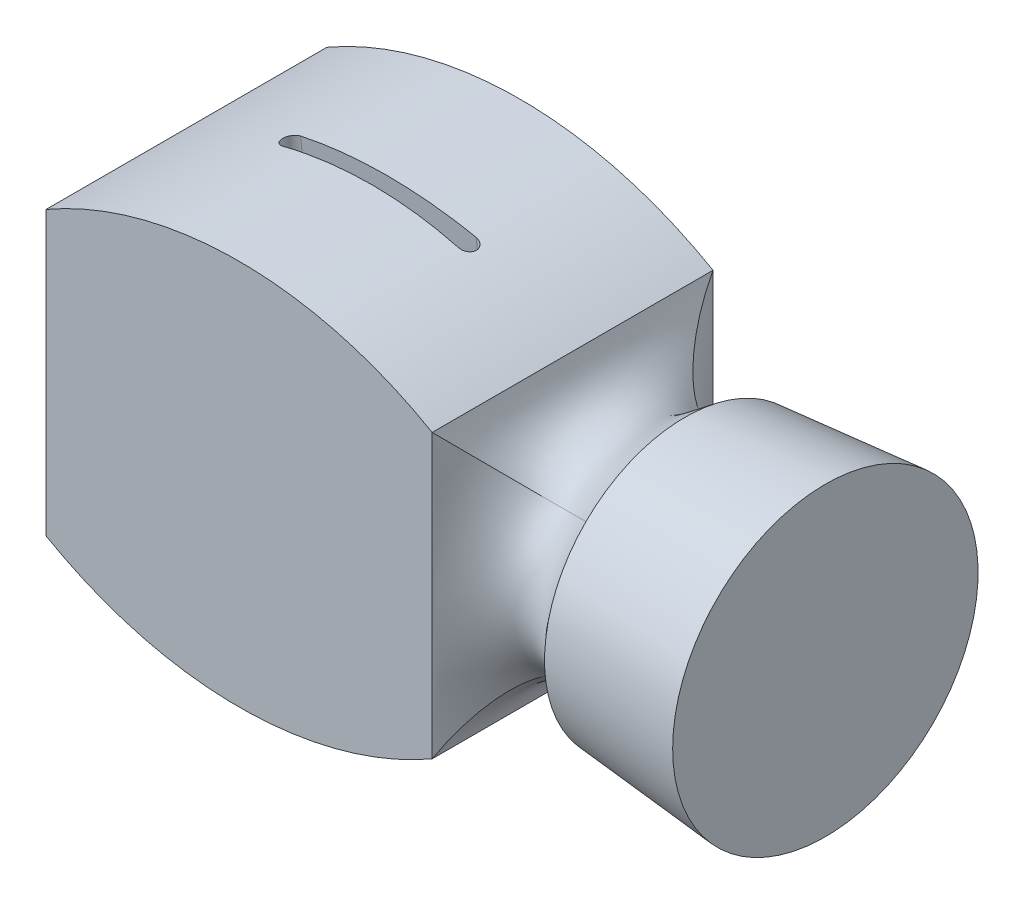
ISO-10303-21;
HEADER;
FILE_DESCRIPTION(('STEP AP214'),'2;1');
FILE_NAME('part.step','',(''),(''),'','','');
FILE_SCHEMA(('AUTOMOTIVE_DESIGN { 1 0 10303 214 1 1 1 1 }'));
ENDSEC;
DATA;
#1=APPLICATION_CONTEXT('core data for automotive mechanical design processes');
#2=APPLICATION_PROTOCOL_DEFINITION('international standard','automotive_design',2000,#1);
#3=PRODUCT_CONTEXT('',#1,'mechanical');
#4=PRODUCT('Part','Part','',(#3));
#5=PRODUCT_RELATED_PRODUCT_CATEGORY('part','',(#4));
#6=PRODUCT_DEFINITION_FORMATION('','',#4);
#7=PRODUCT_DEFINITION_CONTEXT('part definition',#1,'design');
#8=PRODUCT_DEFINITION('design','',#6,#7);
#9=PRODUCT_DEFINITION_SHAPE('','',#8);
#10=(LENGTH_UNIT() NAMED_UNIT(*) SI_UNIT(.MILLI.,.METRE.));
#11=(NAMED_UNIT(*) PLANE_ANGLE_UNIT() SI_UNIT($,.RADIAN.));
#12=(NAMED_UNIT(*) SI_UNIT($,.STERADIAN.) SOLID_ANGLE_UNIT());
#13=UNCERTAINTY_MEASURE_WITH_UNIT(LENGTH_MEASURE(1.E-05),#10,'distance_accuracy_value','');
#14=(GEOMETRIC_REPRESENTATION_CONTEXT(3) GLOBAL_UNCERTAINTY_ASSIGNED_CONTEXT((#13)) GLOBAL_UNIT_ASSIGNED_CONTEXT((#10,
#11,#12)) REPRESENTATION_CONTEXT('',''));
#15=CARTESIAN_POINT('',(0.,0.,0.));
#16=DIRECTION('',(0.,0.,1.));
#17=DIRECTION('',(1.,0.,0.));
#18=AXIS2_PLACEMENT_3D('',#15,#16,#17);
#19=CARTESIAN_POINT('',(0.,27.5,20.));
#20=DIRECTION('',(0.,0.,-1.));
#21=DIRECTION('',(-1.,0.,0.));
#22=AXIS2_PLACEMENT_3D('',#19,#20,#21);
#23=CYLINDRICAL_SURFACE('',#22,55.);
#24=CARTESIAN_POINT('',(0.,27.5,-20.));
#25=DIRECTION('',(0.,0.,1.));
#26=DIRECTION('',(1.,0.,0.));
#27=AXIS2_PLACEMENT_3D('',#24,#25,#26);
#28=CIRCLE('',#27,55.);
#29=CARTESIAN_POINT('',(-27.5,-20.1313972081441,-20.));
#30=VERTEX_POINT('',#29);
#31=CARTESIAN_POINT('',(27.5,-20.1313972081442,-20.));
#32=VERTEX_POINT('',#31);
#33=EDGE_CURVE('E342',#30,#32,#28,.T.);
#34=ORIENTED_EDGE('',*,*,#33,.T.);
#35=DIRECTION('',(0.,0.,-1.));
#36=VECTOR('',#35,1.);
#37=CARTESIAN_POINT('',(27.5,-20.1313972081441,20.));
#38=LINE('',#37,#36);
#39=CARTESIAN_POINT('',(27.5,-20.1313972081442,20.));
#40=VERTEX_POINT('',#39);
#41=EDGE_CURVE('E418',#40,#32,#38,.T.);
#42=ORIENTED_EDGE('',*,*,#41,.F.);
#43=CARTESIAN_POINT('',(0.,27.5,20.));
#44=DIRECTION('',(0.,0.,1.));
#45=DIRECTION('',(1.,0.,0.));
#46=AXIS2_PLACEMENT_3D('',#43,#44,#45);
#47=CIRCLE('',#46,55.);
#48=CARTESIAN_POINT('',(-27.5,-20.1313972081441,20.));
#49=VERTEX_POINT('',#48);
#50=EDGE_CURVE('E432',#49,#40,#47,.T.);
#51=ORIENTED_EDGE('',*,*,#50,.F.);
#52=DIRECTION('',(0.,0.,-1.));
#53=VECTOR('',#52,1.);
#54=CARTESIAN_POINT('',(-27.5,-20.1313972081441,20.));
#55=LINE('',#54,#53);
#56=EDGE_CURVE('E420',#49,#30,#55,.T.);
#57=ORIENTED_EDGE('',*,*,#56,.T.);
#58=EDGE_LOOP('',(#34,#42,#51,#57));
#59=FACE_BOUND('',#58,.T.);
#60=CARTESIAN_POINT('',(-12.4998,-26.0607598896804,6.73909623567953));
#61=CARTESIAN_POINT('',(-12.6933986230128,-26.0155895786751,6.73437127099308));
#62=CARTESIAN_POINT('',(-12.8865370150502,-25.9693982936842,6.72116380482105));
#63=CARTESIAN_POINT('',(-13.2705157264432,-25.8753890942664,6.67807874221884));
#64=CARTESIAN_POINT('',(-13.4613563922318,-25.8275714293182,6.6482036917799));
#65=CARTESIAN_POINT('',(-13.8392681013505,-25.7307501703658,6.57210769917102));
#66=CARTESIAN_POINT('',(-14.0263420870396,-25.6817475735146,6.52590008394693));
#67=CARTESIAN_POINT('',(-14.3956091503976,-25.5829817013322,6.41753635493682));
#68=CARTESIAN_POINT('',(-14.5778021209837,-25.53321840935,6.3553798915703));
#69=CARTESIAN_POINT('',(-14.9360328060622,-25.433444026986,6.21560746732323));
#70=CARTESIAN_POINT('',(-15.1120719910414,-25.3834329991087,6.13799522979766));
#71=CARTESIAN_POINT('',(-15.4569272657897,-25.2836682407866,5.96781267573446));
#72=CARTESIAN_POINT('',(-15.6257406785262,-25.2339146116036,5.87523687507781));
#73=CARTESIAN_POINT('',(-15.9548872673095,-25.1352646526776,5.67578671142501));
#74=CARTESIAN_POINT('',(-16.1152230527839,-25.0863680622711,5.56891678435569));
#75=CARTESIAN_POINT('',(-16.4264231970712,-24.9899911216893,5.34149288505637));
#76=CARTESIAN_POINT('',(-16.5772842743247,-24.9425112651549,5.22093421188979));
#77=CARTESIAN_POINT('',(-16.8693353984987,-24.8492996432912,4.96609901707708));
#78=CARTESIAN_POINT('',(-17.010457453876,-24.8035809938057,4.83173972568182));
#79=CARTESIAN_POINT('',(-17.2808969561019,-24.7148528479504,4.55080355121186));
#80=CARTESIAN_POINT('',(-17.4102147624871,-24.6718432690793,4.4042270405125));
#81=CARTESIAN_POINT('',(-17.6560466401239,-24.5891624389823,4.09976911503502));
#82=CARTESIAN_POINT('',(-17.772558164603,-24.5494918521446,3.94188546189015));
#83=CARTESIAN_POINT('',(-17.9917150660635,-24.4741437326796,3.61596416553342));
#84=CARTESIAN_POINT('',(-18.0943662969913,-24.4384645153814,3.44793085274331));
#85=CARTESIAN_POINT('',(-18.2821852842605,-24.3726452137291,3.10780601269508));
#86=CARTESIAN_POINT('',(-18.3677713386114,-24.3423752211145,2.93597063701547));
#87=CARTESIAN_POINT('',(-18.5242318456487,-24.2866752476319,2.58505335625933));
#88=CARTESIAN_POINT('',(-18.5951124771637,-24.2612432343479,2.40597453263682));
#89=CARTESIAN_POINT('',(-18.7215126445354,-24.215659935032,2.04184725389896));
#90=CARTESIAN_POINT('',(-18.7770343368178,-24.1955079077004,1.8567996408914));
#91=CARTESIAN_POINT('',(-18.8721632651499,-24.1608558050906,1.4821408777441));
#92=CARTESIAN_POINT('',(-18.9117711951019,-24.1463554833767,1.29252992696596));
#93=CARTESIAN_POINT('',(-18.9730585596742,-24.123870998546,0.91997613413624));
#94=CARTESIAN_POINT('',(-18.9955461848687,-24.1155933664036,0.737183540902859));
#95=CARTESIAN_POINT('',(-19.0255878113364,-24.104527587101,0.370211933173798));
#96=CARTESIAN_POINT('',(-19.0331423024459,-24.1017392598808,0.186032964352901));
#97=CARTESIAN_POINT('',(-19.0332430066832,-24.1017021047224,-0.182301940156798));
#98=CARTESIAN_POINT('',(-19.0257913864261,-24.1044524770947,-0.366457875332053));
#99=CARTESIAN_POINT('',(-18.9959583613963,-24.1154416621487,-0.733390169724651));
#100=CARTESIAN_POINT('',(-18.9735770666335,-24.1236804343889,-0.916166539097337));
#101=CARTESIAN_POINT('',(-18.914897551442,-24.1452088406323,-1.27415205667121));
#102=CARTESIAN_POINT('',(-18.8789854734279,-24.1583582501097,-1.44943315112719));
#103=CARTESIAN_POINT('',(-18.7935364114477,-24.1895062408266,-1.79626252287539));
#104=CARTESIAN_POINT('',(-18.7439948815252,-24.2075064399535,-1.96780953406702));
#105=CARTESIAN_POINT('',(-18.6317415182922,-24.2480604898581,-2.30592351966664));
#106=CARTESIAN_POINT('',(-18.5690335982871,-24.270612987528,-2.47249195703617));
#107=CARTESIAN_POINT('',(-18.4309355903424,-24.3199381261802,-2.79970821544439));
#108=CARTESIAN_POINT('',(-18.3555407299215,-24.3467123550233,-2.96035378063281));
#109=CARTESIAN_POINT('',(-18.1909173022932,-24.4047040624393,-3.27809005920096));
#110=CARTESIAN_POINT('',(-18.1014247944717,-24.4360051193682,-3.43502873040355));
#111=CARTESIAN_POINT('',(-17.9105041218743,-24.5021542626677,-3.74075331742193));
#112=CARTESIAN_POINT('',(-17.8090718397584,-24.5370035720634,-3.88953639476775));
#113=CARTESIAN_POINT('',(-17.5950467888048,-24.60976010422,-4.17802674737951));
#114=CARTESIAN_POINT('',(-17.4824549698597,-24.6476670666643,-4.31773479343341));
#115=CARTESIAN_POINT('',(-17.2468766088228,-24.7260534193872,-4.58732219686196));
#116=CARTESIAN_POINT('',(-17.123889598005,-24.7665329256429,-4.71720111053362));
#117=CARTESIAN_POINT('',(-16.8620524023629,-24.8516098086571,-4.97254509389729));
#118=CARTESIAN_POINT('',(-16.7227200258822,-24.8963117771305,-5.09748119879994));
#119=CARTESIAN_POINT('',(-16.4344969250793,-24.9874284501875,-5.33499973797696));
#120=CARTESIAN_POINT('',(-16.2856089381639,-25.0338426626567,-5.44758568539799));
#121=CARTESIAN_POINT('',(-15.9790631101051,-25.1278943791535,-5.65989491074874));
#122=CARTESIAN_POINT('',(-15.8213967782027,-25.1755330426781,-5.7596054144891));
#123=CARTESIAN_POINT('',(-15.4984942160129,-25.2714414426776,-5.94540439208028));
#124=CARTESIAN_POINT('',(-15.3332605660804,-25.3197109600862,-6.0314974653489));
#125=CARTESIAN_POINT('',(-14.9899286385814,-25.4181925493264,-6.19251258698327));
#126=CARTESIAN_POINT('',(-14.8115804242605,-25.4684100001874,-6.26689901101253));
#127=CARTESIAN_POINT('',(-14.4490717910435,-25.5684431780532,-6.39992386049626));
#128=CARTESIAN_POINT('',(-14.2649134977362,-25.6182590437905,-6.45856797222168));
#129=CARTESIAN_POINT('',(-13.8922860767618,-25.7169285109068,-6.5596013948447));
#130=CARTESIAN_POINT('',(-13.7038243930244,-25.765783536674,-6.60201680954808));
#131=CARTESIAN_POINT('',(-13.3236794505999,-25.8621398044004,-6.67032735956453));
#132=CARTESIAN_POINT('',(-13.1319982414434,-25.9096418593275,-6.69623262441011));
#133=CARTESIAN_POINT('',(-12.8663173362054,-25.9739520676846,-6.72039644340137));
#134=CARTESIAN_POINT('',(-12.7930998940024,-25.991515949582,-6.72583563688397));
#135=CARTESIAN_POINT('',(-12.6465455331854,-26.0263537757854,-6.73428466654579));
#136=CARTESIAN_POINT('',(-12.5732088492033,-26.0436280306414,-6.73729729268165));
#137=CARTESIAN_POINT('',(-12.4998,-26.0607598896804,-6.73909623567953));
#138=B_SPLINE_CURVE_WITH_KNOTS('',3,(#60,#61,#62,#63,#64,#65,#66,#67,#68,#69,#70,#71,#72,#73,
#74,#75,#76,#77,#78,#79,#80,#81,#82,#83,#84,#85,#86,#87,#88,#89,#90,#91,#92,#93,#94,#95,#96,#97,
#98,#99,#100,#101,#102,#103,#104,#105,#106,#107,#108,#109,#110,#111,#112,#113,#114,#115,#116,
#117,#118,#119,#120,#121,#122,#123,#124,#125,#126,#127,#128,#129,#130,#131,#132,#133,#134,#135,
#136,#137),.UNSPECIFIED.,.F.,.F.,(4,2,2,2,2,2,2,2,2,2,2,2,2,2,2,2,2,2,2,2,2,2,2,2,2,2,2,2,2,2,2,
2,2,2,2,2,2,2,4),(0.,0.59636044557011,1.19262982137834,1.78841377590823,2.38421079045609,
2.97986444848205,3.57573690957211,4.1714248794858,4.76731804055025,5.36702068937904,
5.96670506622062,6.56650848674251,7.16605778031484,7.74834435579328,8.33038577217038,
8.91234542724771,9.49427970385089,10.0466669181627,10.5990360127869,11.1513253608783,
11.7036106394509,12.2412008860415,12.7789706578923,13.3165808198701,13.8543936701002,
14.4038389820191,14.9534743241039,15.5030629216938,16.0526763138252,16.6292479140974,
17.2056550741787,17.7826297850139,18.3594091990297,18.9576750939366,19.5557245979138,
20.1528080561528,20.7495248300466,20.9759665058355,21.2021474561636),.UNSPECIFIED.);
#139=CARTESIAN_POINT('',(-12.5,-26.0607132140714,6.73909133284309));
#140=VERTEX_POINT('',#139);
#141=CARTESIAN_POINT('',(-12.5,-26.0607132140714,-6.73909133284309));
#142=VERTEX_POINT('',#141);
#143=EDGE_CURVE('E195',#140,#142,#138,.T.);
#144=ORIENTED_EDGE('',*,*,#143,.F.);
#145=CARTESIAN_POINT('',(0.,27.5,1.10963353019389));
#146=DIRECTION('',(0.,0.104528463267654,0.994521895368273));
#147=DIRECTION('',(0.,0.994521895368273,-0.104528463267654));
#148=AXIS2_PLACEMENT_3D('',#145,#146,#147);
#149=ELLIPSE('',#148,55.3029553759934,55.);
#150=CARTESIAN_POINT('',(12.5,-26.0607132140714,6.73909133284309));
#151=VERTEX_POINT('',#150);
#152=EDGE_CURVE('E193',#151,#140,#149,.F.);
#153=ORIENTED_EDGE('',*,*,#152,.F.);
#154=CARTESIAN_POINT('',(12.4998,-26.0607598896804,-6.73909623567953));
#155=CARTESIAN_POINT('',(12.6933986230128,-26.0155895786751,-6.73437127099308));
#156=CARTESIAN_POINT('',(12.8865370150502,-25.9693982936842,-6.72116380482105));
#157=CARTESIAN_POINT('',(13.2705157264432,-25.8753890942664,-6.67807874221884));
#158=CARTESIAN_POINT('',(13.4613563922318,-25.8275714293182,-6.64820369177991));
#159=CARTESIAN_POINT('',(13.8392681013505,-25.7307501703658,-6.57210769917102));
#160=CARTESIAN_POINT('',(14.0263420870396,-25.6817475735146,-6.52590008394693));
#161=CARTESIAN_POINT('',(14.3956091503976,-25.5829817013322,-6.41753635493682));
#162=CARTESIAN_POINT('',(14.5778021209837,-25.53321840935,-6.3553798915703));
#163=CARTESIAN_POINT('',(14.9360328060622,-25.433444026986,-6.21560746732323));
#164=CARTESIAN_POINT('',(15.1120719910414,-25.3834329991087,-6.13799522979766));
#165=CARTESIAN_POINT('',(15.4569272657897,-25.2836682407866,-5.96781267573446));
#166=CARTESIAN_POINT('',(15.6257406785262,-25.2339146116036,-5.87523687507781));
#167=CARTESIAN_POINT('',(15.9548872673095,-25.1352646526776,-5.67578671142501));
#168=CARTESIAN_POINT('',(16.1152230527839,-25.0863680622711,-5.56891678435569));
#169=CARTESIAN_POINT('',(16.4264231970712,-24.9899911216893,-5.34149288505637));
#170=CARTESIAN_POINT('',(16.5772842743247,-24.942511265155,-5.2209342118898));
#171=CARTESIAN_POINT('',(16.8693353984987,-24.8492996432912,-4.96609901707708));
#172=CARTESIAN_POINT('',(17.010457453876,-24.8035809938058,-4.83173972568183));
#173=CARTESIAN_POINT('',(17.2808969561019,-24.7148528479504,-4.55080355121187));
#174=CARTESIAN_POINT('',(17.4102147624871,-24.6718432690793,-4.40422704051251));
#175=CARTESIAN_POINT('',(17.6560466401239,-24.5891624389823,-4.09976911503503));
#176=CARTESIAN_POINT('',(17.772558164603,-24.5494918521446,-3.94188546189015));
#177=CARTESIAN_POINT('',(17.9917150660635,-24.4741437326796,-3.61596416553343));
#178=CARTESIAN_POINT('',(18.0943662969913,-24.4384645153814,-3.44793085274331));
#179=CARTESIAN_POINT('',(18.2821852842605,-24.3726452137291,-3.10780601269509));
#180=CARTESIAN_POINT('',(18.3677713386114,-24.3423752211145,-2.93597063701547));
#181=CARTESIAN_POINT('',(18.5242318456487,-24.2866752476319,-2.58505335625934));
#182=CARTESIAN_POINT('',(18.5951124771637,-24.2612432343479,-2.40597453263682));
#183=CARTESIAN_POINT('',(18.7215126445354,-24.215659935032,-2.04184725389896));
#184=CARTESIAN_POINT('',(18.7770343368178,-24.1955079077005,-1.8567996408914));
#185=CARTESIAN_POINT('',(18.8721632651499,-24.1608558050907,-1.4821408777441));
#186=CARTESIAN_POINT('',(18.9117711951019,-24.1463554833767,-1.29252992696597));
#187=CARTESIAN_POINT('',(18.9730585596742,-24.123870998546,-0.919976134136245));
#188=CARTESIAN_POINT('',(18.9955461848687,-24.1155933664036,-0.737183540902863));
#189=CARTESIAN_POINT('',(19.0255878113364,-24.104527587101,-0.370211933173802));
#190=CARTESIAN_POINT('',(19.0331423024459,-24.1017392598808,-0.186032964352906));
#191=CARTESIAN_POINT('',(19.0332430066832,-24.1017021047224,0.182301940156793));
#192=CARTESIAN_POINT('',(19.0257913864261,-24.1044524770948,0.366457875332048));
#193=CARTESIAN_POINT('',(18.9959583613963,-24.1154416621487,0.733390169724646));
#194=CARTESIAN_POINT('',(18.9735770666335,-24.1236804343889,0.916166539097332));
#195=CARTESIAN_POINT('',(18.914897551442,-24.1452088406323,1.27415205667121));
#196=CARTESIAN_POINT('',(18.8789854734279,-24.1583582501097,1.44943315112719));
#197=CARTESIAN_POINT('',(18.7935364114477,-24.1895062408266,1.79626252287539));
#198=CARTESIAN_POINT('',(18.7439948815252,-24.2075064399535,1.96780953406701));
#199=CARTESIAN_POINT('',(18.6317415182922,-24.2480604898581,2.30592351966664));
#200=CARTESIAN_POINT('',(18.5690335982871,-24.270612987528,2.47249195703616));
#201=CARTESIAN_POINT('',(18.4309355903424,-24.3199381261802,2.79970821544438));
#202=CARTESIAN_POINT('',(18.3555407299215,-24.3467123550233,2.96035378063281));
#203=CARTESIAN_POINT('',(18.1909173022932,-24.4047040624393,3.27809005920096));
#204=CARTESIAN_POINT('',(18.1014247944717,-24.4360051193682,3.43502873040355));
#205=CARTESIAN_POINT('',(17.9105041218743,-24.5021542626677,3.74075331742193));
#206=CARTESIAN_POINT('',(17.8090718397584,-24.5370035720634,3.88953639476775));
#207=CARTESIAN_POINT('',(17.5950467888048,-24.60976010422,4.1780267473795));
#208=CARTESIAN_POINT('',(17.4824549698597,-24.6476670666643,4.3177347934334));
#209=CARTESIAN_POINT('',(17.2468766088228,-24.7260534193872,4.58732219686196));
#210=CARTESIAN_POINT('',(17.123889598005,-24.7665329256429,4.71720111053362));
#211=CARTESIAN_POINT('',(16.8620524023629,-24.8516098086571,4.97254509389728));
#212=CARTESIAN_POINT('',(16.7227200258822,-24.8963117771305,5.09748119879994));
#213=CARTESIAN_POINT('',(16.4344969250793,-24.9874284501875,5.33499973797696));
#214=CARTESIAN_POINT('',(16.2856089381639,-25.0338426626567,5.44758568539798));
#215=CARTESIAN_POINT('',(15.9790631101051,-25.1278943791535,5.65989491074874));
#216=CARTESIAN_POINT('',(15.8213967782027,-25.1755330426782,5.7596054144891));
#217=CARTESIAN_POINT('',(15.4984942160129,-25.2714414426776,5.94540439208027));
#218=CARTESIAN_POINT('',(15.3332605660804,-25.3197109600862,6.0314974653489));
#219=CARTESIAN_POINT('',(14.9899286385814,-25.4181925493265,6.19251258698326));
#220=CARTESIAN_POINT('',(14.8115804242605,-25.4684100001874,6.26689901101253));
#221=CARTESIAN_POINT('',(14.4490717910435,-25.5684431780532,6.39992386049626));
#222=CARTESIAN_POINT('',(14.2649134977362,-25.6182590437906,6.45856797222168));
#223=CARTESIAN_POINT('',(13.8922860767618,-25.7169285109068,6.5596013948447));
#224=CARTESIAN_POINT('',(13.7038243930244,-25.765783536674,6.60201680954807));
#225=CARTESIAN_POINT('',(13.3236794505999,-25.8621398044004,6.67032735956453));
#226=CARTESIAN_POINT('',(13.1319982414434,-25.9096418593275,6.6962326244101));
#227=CARTESIAN_POINT('',(12.8663173362054,-25.9739520676846,6.72039644340137));
#228=CARTESIAN_POINT('',(12.7930998940024,-25.991515949582,6.72583563688397));
#229=CARTESIAN_POINT('',(12.6465455331854,-26.0263537757854,6.73428466654579));
#230=CARTESIAN_POINT('',(12.5732088492033,-26.0436280306414,6.73729729268165));
#231=CARTESIAN_POINT('',(12.4998,-26.0607598896805,6.73909623567953));
#232=B_SPLINE_CURVE_WITH_KNOTS('',3,(#154,#155,#156,#157,#158,#159,#160,#161,#162,#163,#164,
#165,#166,#167,#168,#169,#170,#171,#172,#173,#174,#175,#176,#177,#178,#179,#180,#181,#182,#183,
#184,#185,#186,#187,#188,#189,#190,#191,#192,#193,#194,#195,#196,#197,#198,#199,#200,#201,#202,
#203,#204,#205,#206,#207,#208,#209,#210,#211,#212,#213,#214,#215,#216,#217,#218,#219,#220,#221,
#222,#223,#224,#225,#226,#227,#228,#229,#230,#231),.UNSPECIFIED.,.F.,.F.,(4,2,2,2,2,2,2,2,2,2,2,
2,2,2,2,2,2,2,2,2,2,2,2,2,2,2,2,2,2,2,2,2,2,2,2,2,2,2,4),(0.,0.596360445570109,1.19262982137834,
1.78841377590823,2.38421079045609,2.97986444848205,3.57573690957211,4.1714248794858,
4.76731804055024,5.36702068937903,5.96670506622062,6.56650848674251,7.16605778031484,
7.74834435579328,8.33038577217037,8.91234542724771,9.49427970385089,10.0466669181627,
10.5990360127869,11.1513253608783,11.7036106394509,12.2412008860415,12.7789706578923,
13.3165808198701,13.8543936701002,14.4038389820191,14.9534743241039,15.5030629216938,
16.0526763138252,16.6292479140974,17.2056550741787,17.7826297850139,18.3594091990297,
18.9576750939366,19.5557245979138,20.1528080561528,20.7495248300466,20.9759665058355,
21.2021474561636),.UNSPECIFIED.);
#233=CARTESIAN_POINT('',(12.5,-26.0607132140714,-6.73909133284309));
#234=VERTEX_POINT('',#233);
#235=EDGE_CURVE('E180',#234,#151,#232,.T.);
#236=ORIENTED_EDGE('',*,*,#235,.F.);
#237=CARTESIAN_POINT('',(0.,27.5,-1.10963353019389));
#238=DIRECTION('',(0.,0.104528463267654,-0.994521895368273));
#239=DIRECTION('',(0.,-0.994521895368273,-0.104528463267654));
#240=AXIS2_PLACEMENT_3D('',#237,#238,#239);
#241=ELLIPSE('',#240,55.3029553759934,55.);
#242=EDGE_CURVE('E175',#142,#234,#241,.F.);
#243=ORIENTED_EDGE('',*,*,#242,.F.);
#244=EDGE_LOOP('',(#144,#153,#236,#243));
#245=FACE_BOUND('',#244,.T.);
#246=ADVANCED_FACE('F97',(#59,#245),#23,.T.);
#247=CARTESIAN_POINT('',(0.,-27.5,20.));
#248=DIRECTION('',(0.,0.,-1.));
#249=DIRECTION('',(-1.,0.,0.));
#250=AXIS2_PLACEMENT_3D('',#247,#248,#249);
#251=CYLINDRICAL_SURFACE('',#250,55.);
#252=CARTESIAN_POINT('',(0.,-27.5,-20.));
#253=DIRECTION('',(0.,0.,1.));
#254=DIRECTION('',(1.,0.,0.));
#255=AXIS2_PLACEMENT_3D('',#252,#253,#254);
#256=CIRCLE('',#255,55.);
#257=CARTESIAN_POINT('',(27.5,20.1313972081442,-20.));
#258=VERTEX_POINT('',#257);
#259=CARTESIAN_POINT('',(-27.5,20.1313972081441,-20.));
#260=VERTEX_POINT('',#259);
#261=EDGE_CURVE('E423',#258,#260,#256,.T.);
#262=ORIENTED_EDGE('',*,*,#261,.T.);
#263=DIRECTION('',(0.,0.,-1.));
#264=VECTOR('',#263,1.);
#265=CARTESIAN_POINT('',(-27.5,20.1313972081441,20.));
#266=LINE('',#265,#264);
#267=CARTESIAN_POINT('',(-27.5,20.1313972081441,20.));
#268=VERTEX_POINT('',#267);
#269=EDGE_CURVE('E427',#268,#260,#266,.T.);
#270=ORIENTED_EDGE('',*,*,#269,.F.);
#271=CARTESIAN_POINT('',(0.,-27.5,20.));
#272=DIRECTION('',(0.,0.,1.));
#273=DIRECTION('',(1.,0.,0.));
#274=AXIS2_PLACEMENT_3D('',#271,#272,#273);
#275=CIRCLE('',#274,55.);
#276=CARTESIAN_POINT('',(27.5,20.1313972081442,20.));
#277=VERTEX_POINT('',#276);
#278=EDGE_CURVE('E431',#277,#268,#275,.T.);
#279=ORIENTED_EDGE('',*,*,#278,.F.);
#280=DIRECTION('',(0.,0.,-1.));
#281=VECTOR('',#280,1.);
#282=CARTESIAN_POINT('',(27.5,20.1313972081441,20.));
#283=LINE('',#282,#281);
#284=EDGE_CURVE('E425',#277,#258,#283,.T.);
#285=ORIENTED_EDGE('',*,*,#284,.T.);
#286=EDGE_LOOP('',(#262,#270,#279,#285));
#287=FACE_BOUND('',#286,.T.);
#288=CARTESIAN_POINT('',(-12.4998,26.0607598896804,-1.26090374549108));
#289=CARTESIAN_POINT('',(-12.5362743296675,26.0522478709872,-1.26180340507667));
#290=CARTESIAN_POINT('',(-12.5727590787317,26.0436936480479,-1.26112548003771));
#291=CARTESIAN_POINT('',(-12.6455261224922,26.0265547476194,-1.25662610110994));
#292=CARTESIAN_POINT('',(-12.6818084217784,26.017970070828,-1.25280471878372));
#293=CARTESIAN_POINT('',(-12.7899537101671,25.9922662710829,-1.23665258322578));
#294=CARTESIAN_POINT('',(-12.8611821390197,25.9751817246543,-1.21963542791976));
#295=CARTESIAN_POINT('',(-12.9997881749117,25.941656118787,-1.17352338342164));
#296=CARTESIAN_POINT('',(-13.0671634866197,25.9252154447087,-1.1444213787278));
#297=CARTESIAN_POINT('',(-13.1960763666687,25.8935199551527,-1.07487099161981));
#298=CARTESIAN_POINT('',(-13.2576159564044,25.878264729389,-1.03442655738208));
#299=CARTESIAN_POINT('',(-13.3723456450101,25.8496376455671,-0.943731478172326));
#300=CARTESIAN_POINT('',(-13.4256203883634,25.8362468618391,-0.893593972157105));
#301=CARTESIAN_POINT('',(-13.5229338262441,25.8116571294908,-0.78455794175168));
#302=CARTESIAN_POINT('',(-13.5669724943479,25.8004581871412,-0.725659392297728));
#303=CARTESIAN_POINT('',(-13.6431896304049,25.7809992905679,-0.602577360308661));
#304=CARTESIAN_POINT('',(-13.675672479131,25.7726641460899,-0.538594317729464));
#305=CARTESIAN_POINT('',(-13.7293797691137,25.7588481461959,-0.405782983576556));
#306=CARTESIAN_POINT('',(-13.7506071455625,25.7533665466418,-0.336955960520344));
#307=CARTESIAN_POINT('',(-13.7805758317647,25.7456191950105,-0.198693685679633));
#308=CARTESIAN_POINT('',(-13.789681944994,25.7432594996914,-0.129342619853301));
#309=CARTESIAN_POINT('',(-13.7962919326474,25.7415471406741,0.00994517257850195));
#310=CARTESIAN_POINT('',(-13.7937969318513,25.742194185459,0.0798818417508441));
#311=CARTESIAN_POINT('',(-13.7774270684507,25.7464324712601,0.217181101230705));
#312=CARTESIAN_POINT('',(-13.7637339612944,25.7499766881428,0.284566944333061));
#313=CARTESIAN_POINT('',(-13.7256619977666,25.7598027211403,0.416034079657959));
#314=CARTESIAN_POINT('',(-13.7012830589086,25.7660845583874,0.480115346367427));
#315=CARTESIAN_POINT('',(-13.6424051035998,25.7811947013412,0.603715790483114));
#316=CARTESIAN_POINT('',(-13.6078310457899,25.7900418809469,0.663196857467384));
#317=CARTESIAN_POINT('',(-13.529709607402,25.8099294478566,0.775522585296219));
#318=CARTESIAN_POINT('',(-13.4861614093846,25.8209700349512,0.828366640880341));
#319=CARTESIAN_POINT('',(-13.3901206039142,25.8451701712333,0.927415827713198));
#320=CARTESIAN_POINT('',(-13.3374239360364,25.85837756838,0.973411295017272));
#321=CARTESIAN_POINT('',(-13.2254218411926,25.8862486392757,1.0559700734049));
#322=CARTESIAN_POINT('',(-13.1661140596511,25.9009128316647,1.0925300085165));
#323=CARTESIAN_POINT('',(-13.0405676421217,25.931712513302,1.15635945680386));
#324=CARTESIAN_POINT('',(-12.9741691555963,25.9478798623625,1.18329867416451));
#325=CARTESIAN_POINT('',(-12.8379416878603,25.9807642599544,1.22556922164406));
#326=CARTESIAN_POINT('',(-12.7681159259784,25.9974807879245,1.24091123123124));
#327=CARTESIAN_POINT('',(-12.6647833113039,26.0219993028902,1.25463643893451));
#328=CARTESIAN_POINT('',(-12.6318353745957,26.0297850272688,1.25770138600604));
#329=CARTESIAN_POINT('',(-12.5658554301043,26.045311881919,1.26123973157955));
#330=CARTESIAN_POINT('',(-12.5328236951845,26.0530530683882,1.26171797097046));
#331=CARTESIAN_POINT('',(-12.4998,26.0607598896804,1.26090374549109));
#332=B_SPLINE_CURVE_WITH_KNOTS('',3,(#288,#289,#290,#291,#292,#293,#294,#295,#296,#297,#298,
#299,#300,#301,#302,#303,#304,#305,#306,#307,#308,#309,#310,#311,#312,#313,#314,#315,#316,#317,
#318,#319,#320,#321,#322,#323,#324,#325,#326,#327,#328,#329,#330,#331),.UNSPECIFIED.,.F.,.F.,(4,
2,2,2,2,2,2,2,2,2,2,2,2,2,2,2,2,2,2,2,2,4),(0.,0.112326316050351,0.224650074999323,
0.449093594371362,0.673669452817843,0.898167235670884,1.12018763401675,1.34220866753471,
1.55785133880954,1.77343774728539,1.98237696278586,2.19129592111884,2.39688969729956,
2.6024850605352,2.80963318388982,3.01680018436563,3.2293828418207,3.44204145484825,
3.66142395121591,3.88060417888031,3.9825021304944,4.08420931923978),.UNSPECIFIED.);
#333=CARTESIAN_POINT('',(-12.5,26.0607132140714,-1.26090866715691));
#334=VERTEX_POINT('',#333);
#335=CARTESIAN_POINT('',(-12.5,26.0607132140714,1.26090866715691));
#336=VERTEX_POINT('',#335);
#337=EDGE_CURVE('E12',#334,#336,#332,.T.);
#338=ORIENTED_EDGE('',*,*,#337,.F.);
#339=CARTESIAN_POINT('',(0.,-27.5,-6.89036646980611));
#340=DIRECTION('',(0.,0.104528463267654,-0.994521895368273));
#341=DIRECTION('',(0.,-0.994521895368273,-0.104528463267654));
#342=AXIS2_PLACEMENT_3D('',#339,#340,#341);
#343=ELLIPSE('',#342,55.3029553759934,55.);
#344=CARTESIAN_POINT('',(12.5,26.0607132140714,-1.26090866715691));
#345=VERTEX_POINT('',#344);
#346=EDGE_CURVE('E217',#345,#334,#343,.F.);
#347=ORIENTED_EDGE('',*,*,#346,.F.);
#348=CARTESIAN_POINT('',(12.4998,26.0607598896804,1.26090374549108));
#349=CARTESIAN_POINT('',(12.5362743296675,26.0522478709872,1.26180340507667));
#350=CARTESIAN_POINT('',(12.5727590787317,26.0436936480479,1.26112548003771));
#351=CARTESIAN_POINT('',(12.6455261224922,26.0265547476194,1.25662610110994));
#352=CARTESIAN_POINT('',(12.6818084217784,26.017970070828,1.25280471878371));
#353=CARTESIAN_POINT('',(12.7899537101671,25.9922662710829,1.23665258322578));
#354=CARTESIAN_POINT('',(12.8611821390197,25.9751817246543,1.21963542791976));
#355=CARTESIAN_POINT('',(12.9997881749117,25.9416561187871,1.17352338342164));
#356=CARTESIAN_POINT('',(13.0671634866197,25.9252154447087,1.14442137872779));
#357=CARTESIAN_POINT('',(13.1960763666687,25.8935199551527,1.07487099161981));
#358=CARTESIAN_POINT('',(13.2576159564044,25.878264729389,1.03442655738208));
#359=CARTESIAN_POINT('',(13.3723456450101,25.8496376455671,0.943731478172319));
#360=CARTESIAN_POINT('',(13.4256203883634,25.8362468618391,0.893593972157098));
#361=CARTESIAN_POINT('',(13.5229338262441,25.8116571294908,0.784557941751671));
#362=CARTESIAN_POINT('',(13.5669724943479,25.8004581871412,0.725659392297717));
#363=CARTESIAN_POINT('',(13.6431896304049,25.780999290568,0.60257736030865));
#364=CARTESIAN_POINT('',(13.675672479131,25.7726641460899,0.538594317729453));
#365=CARTESIAN_POINT('',(13.7293797691137,25.7588481461959,0.405782983576546));
#366=CARTESIAN_POINT('',(13.7506071455625,25.7533665466418,0.336955960520334));
#367=CARTESIAN_POINT('',(13.7805758317647,25.7456191950105,0.198693685679623));
#368=CARTESIAN_POINT('',(13.789681944994,25.7432594996914,0.129342619853292));
#369=CARTESIAN_POINT('',(13.7962919326474,25.7415471406741,-0.00994517257851129));
#370=CARTESIAN_POINT('',(13.7937969318513,25.742194185459,-0.0798818417508539));
#371=CARTESIAN_POINT('',(13.7774270684507,25.7464324712601,-0.217181101230715));
#372=CARTESIAN_POINT('',(13.7637339612944,25.7499766881428,-0.28456694433307));
#373=CARTESIAN_POINT('',(13.7256619977666,25.7598027211403,-0.416034079657967));
#374=CARTESIAN_POINT('',(13.7012830589086,25.7660845583874,-0.480115346367436));
#375=CARTESIAN_POINT('',(13.6424051035998,25.7811947013412,-0.603715790483124));
#376=CARTESIAN_POINT('',(13.6078310457899,25.7900418809469,-0.663196857467393));
#377=CARTESIAN_POINT('',(13.529709607402,25.8099294478566,-0.775522585296228));
#378=CARTESIAN_POINT('',(13.4861614093846,25.8209700349512,-0.828366640880349));
#379=CARTESIAN_POINT('',(13.3901206039142,25.8451701712333,-0.927415827713206));
#380=CARTESIAN_POINT('',(13.3374239360364,25.85837756838,-0.97341129501728));
#381=CARTESIAN_POINT('',(13.2254218411926,25.8862486392757,-1.05597007340491));
#382=CARTESIAN_POINT('',(13.1661140596511,25.9009128316647,-1.09253000851651));
#383=CARTESIAN_POINT('',(13.0405676421217,25.931712513302,-1.15635945680387));
#384=CARTESIAN_POINT('',(12.9741691555963,25.9478798623625,-1.18329867416451));
#385=CARTESIAN_POINT('',(12.8379416878603,25.9807642599544,-1.22556922164407));
#386=CARTESIAN_POINT('',(12.7681159259784,25.9974807879245,-1.24091123123124));
#387=CARTESIAN_POINT('',(12.6647833113039,26.0219993028902,-1.25463643893451));
#388=CARTESIAN_POINT('',(12.6318353745957,26.0297850272688,-1.25770138600604));
#389=CARTESIAN_POINT('',(12.5658554301043,26.045311881919,-1.26123973157955));
#390=CARTESIAN_POINT('',(12.5328236951845,26.0530530683882,-1.26171797097046));
#391=CARTESIAN_POINT('',(12.4998,26.0607598896805,-1.2609037454911));
#392=B_SPLINE_CURVE_WITH_KNOTS('',3,(#348,#349,#350,#351,#352,#353,#354,#355,#356,#357,#358,
#359,#360,#361,#362,#363,#364,#365,#366,#367,#368,#369,#370,#371,#372,#373,#374,#375,#376,#377,
#378,#379,#380,#381,#382,#383,#384,#385,#386,#387,#388,#389,#390,#391),.UNSPECIFIED.,.F.,.F.,(4,
2,2,2,2,2,2,2,2,2,2,2,2,2,2,2,2,2,2,2,2,4),(0.,0.11232631605035,0.224650074999326,
0.449093594371366,0.673669452817847,0.89816723567089,1.12018763401675,1.34220866753472,
1.55785133880955,1.7734377472854,1.98237696278587,2.19129592111885,2.39688969729956,
2.60248506053521,2.80963318388983,3.01680018436563,3.2293828418207,3.44204145484826,
3.66142395121591,3.88060417888032,3.9825021304944,4.08420931923978),.UNSPECIFIED.);
#393=CARTESIAN_POINT('',(12.5,26.0607132140714,1.26090866715691));
#394=VERTEX_POINT('',#393);
#395=EDGE_CURVE('E188',#394,#345,#392,.T.);
#396=ORIENTED_EDGE('',*,*,#395,.F.);
#397=CARTESIAN_POINT('',(0.,-27.5,6.89036646980611));
#398=DIRECTION('',(0.,0.104528463267654,0.994521895368273));
#399=DIRECTION('',(0.,0.994521895368273,-0.104528463267654));
#400=AXIS2_PLACEMENT_3D('',#397,#398,#399);
#401=ELLIPSE('',#400,55.3029553759934,55.);
#402=EDGE_CURVE('E110',#336,#394,#401,.F.);
#403=ORIENTED_EDGE('',*,*,#402,.F.);
#404=EDGE_LOOP('',(#338,#347,#396,#403));
#405=FACE_BOUND('',#404,.T.);
#406=ADVANCED_FACE('F219',(#287,#405),#251,.T.);
#407=CARTESIAN_POINT('',(-27.5,20.1313972081441,20.));
#408=DIRECTION('',(1.,0.,0.));
#409=DIRECTION('',(0.,1.,0.));
#410=AXIS2_PLACEMENT_3D('',#407,#408,#409);
#411=PLANE('',#410);
#412=DIRECTION('',(0.,-1.,0.));
#413=VECTOR('',#412,1.);
#414=CARTESIAN_POINT('',(-27.5,20.1313972081441,-20.));
#415=LINE('',#414,#413);
#416=EDGE_CURVE('E435',#260,#30,#415,.T.);
#417=ORIENTED_EDGE('',*,*,#416,.T.);
#418=ORIENTED_EDGE('',*,*,#56,.F.);
#419=DIRECTION('',(0.,-1.,0.));
#420=VECTOR('',#419,1.);
#421=CARTESIAN_POINT('',(-27.5,20.1313972081441,20.));
#422=LINE('',#421,#420);
#423=EDGE_CURVE('E332',#268,#49,#422,.T.);
#424=ORIENTED_EDGE('',*,*,#423,.F.);
#425=ORIENTED_EDGE('',*,*,#269,.T.);
#426=EDGE_LOOP('',(#417,#418,#424,#425));
#427=FACE_BOUND('',#426,.T.);
#428=ADVANCED_FACE('F223',(#427),#411,.F.);
#429=CARTESIAN_POINT('',(0.,27.5,20.));
#430=DIRECTION('',(0.,0.,1.));
#431=DIRECTION('',(1.,0.,0.));
#432=AXIS2_PLACEMENT_3D('',#429,#430,#431);
#433=PLANE('',#432);
#434=ORIENTED_EDGE('',*,*,#50,.T.);
#435=DIRECTION('',(0.,1.,0.));
#436=VECTOR('',#435,1.);
#437=CARTESIAN_POINT('',(27.5,27.5,20.));
#438=LINE('',#437,#436);
#439=EDGE_CURVE('E430',#40,#277,#438,.T.);
#440=ORIENTED_EDGE('',*,*,#439,.T.);
#441=ORIENTED_EDGE('',*,*,#278,.T.);
#442=ORIENTED_EDGE('',*,*,#423,.T.);
#443=EDGE_LOOP('',(#434,#440,#441,#442));
#444=FACE_BOUND('',#443,.T.);
#445=ADVANCED_FACE('F228',(#444),#433,.T.);
#446=CARTESIAN_POINT('',(0.,27.5,-20.));
#447=DIRECTION('',(0.,0.,1.));
#448=DIRECTION('',(1.,0.,0.));
#449=AXIS2_PLACEMENT_3D('',#446,#447,#448);
#450=PLANE('',#449);
#451=ORIENTED_EDGE('',*,*,#33,.F.);
#452=ORIENTED_EDGE('',*,*,#416,.F.);
#453=ORIENTED_EDGE('',*,*,#261,.F.);
#454=DIRECTION('',(0.,1.,0.));
#455=VECTOR('',#454,1.);
#456=CARTESIAN_POINT('',(27.5,27.5,-20.));
#457=LINE('',#456,#455);
#458=EDGE_CURVE('E344',#32,#258,#457,.T.);
#459=ORIENTED_EDGE('',*,*,#458,.F.);
#460=EDGE_LOOP('',(#451,#452,#453,#459));
#461=FACE_BOUND('',#460,.T.);
#462=ADVANCED_FACE('F230',(#461),#450,.F.);
#463=CARTESIAN_POINT('',(27.5,20.1313972081441,20.));
#464=CARTESIAN_POINT('',(28.9080305961876,15.2626603647518,15.1630413000617));
#465=CARTESIAN_POINT('',(35.2764358777614,8.46344386213961,8.40820314122631));
#466=CARTESIAN_POINT('',(39.5746972628543,11.300637823568,11.2268787970626));
#467=CARTESIAN_POINT('',(43.5,14.1883633963684,14.0957562455014));
#468=CARTESIAN_POINT('',(27.5,18.4537807741321,20.));
#469=CARTESIAN_POINT('',(29.0920379970841,13.9873941243925,15.3401295397655));
#470=CARTESIAN_POINT('',(35.0849762787596,8.01615177547857,9.23834972489185));
#471=CARTESIAN_POINT('',(39.7587046637507,10.5341677957315,12.0536850909214));
#472=CARTESIAN_POINT('',(43.5,13.2497873366396,15.0404986189242));
#473=CARTESIAN_POINT('',(27.5,15.0985479061081,20.));
#474=CARTESIAN_POINT('',(29.4600527988769,11.436861643674,15.694306019173));
#475=CARTESIAN_POINT('',(34.7020570807558,6.97659066476343,10.7195498120906));
#476=CARTESIAN_POINT('',(40.1267194655436,8.83389319671124,13.5005857745286));
#477=CARTESIAN_POINT('',(43.5000000000001,11.2053006738346,16.7232714616593));
#478=CARTESIAN_POINT('',(27.5,10.0656986040721,20.));
#479=CARTESIAN_POINT('',(29.8804233282729,7.64216315097123,16.2103094898181));
#480=CARTESIAN_POINT('',(34.264661777098,4.91050361997452,12.1978182478904));
#481=CARTESIAN_POINT('',(40.5470899949396,6.08689108597139,15.2681853685108));
#482=CARTESIAN_POINT('',(43.5,7.72980238972683,18.5830844795628));
#483=CARTESIAN_POINT('',(27.5,5.03284930203603,20.));
#484=CARTESIAN_POINT('',(30.1180016012872,3.84068983533146,16.5767458288723));
#485=CARTESIAN_POINT('',(34.0174617152456,2.55438969053004,13.0709061020506));
#486=CARTESIAN_POINT('',(40.784668267954,3.13421842189524,16.3989292902857));
#487=CARTESIAN_POINT('',(43.5,3.97388921109307,19.734340717399));
#488=CARTESIAN_POINT('',(27.5,0.,20.));
#489=CARTESIAN_POINT('',(30.1909991993564,0.,16.7116270855638));
#490=CARTESIAN_POINT('',(33.9415077547729,0.,13.3632983297731));
#491=CARTESIAN_POINT('',(40.857665866023,0.,16.8005353548571));
#492=CARTESIAN_POINT('',(43.4999999999999,0.,20.1328296413005));
#493=CARTESIAN_POINT('',(27.5,-5.03284930203605,20.));
#494=CARTESIAN_POINT('',(30.1180016012872,-3.84068983533146,16.5767458288723));
#495=CARTESIAN_POINT('',(34.0174617152454,-2.55438969053004,13.0709061020506));
#496=CARTESIAN_POINT('',(40.784668267954,-3.13421842189524,16.3989292902858));
#497=CARTESIAN_POINT('',(43.5000000000001,-3.97388921109308,19.734340717399));
#498=CARTESIAN_POINT('',(27.5,-10.0656986040721,20.));
#499=CARTESIAN_POINT('',(29.880423328273,-7.64216315097125,16.2103094898181));
#500=CARTESIAN_POINT('',(34.2646617770982,-4.91050361997453,12.1978182478903));
#501=CARTESIAN_POINT('',(40.5470899949396,-6.0868910859714,15.2681853685107));
#502=CARTESIAN_POINT('',(43.4999999999999,-7.72980238972684,18.5830844795628));
#503=CARTESIAN_POINT('',(27.5,-15.0985479061081,20.));
#504=CARTESIAN_POINT('',(29.4600527988769,-11.436861643674,15.694306019173));
#505=CARTESIAN_POINT('',(34.7020570807557,-6.97659066476342,10.7195498120906));
#506=CARTESIAN_POINT('',(40.1267194655436,-8.83389319671125,13.5005857745286));
#507=CARTESIAN_POINT('',(43.5000000000001,-11.2053006738346,16.7232714616593));
#508=CARTESIAN_POINT('',(27.5,-18.4537807741321,20.));
#509=CARTESIAN_POINT('',(29.092037997084,-13.9873941243925,15.3401295397655));
#510=CARTESIAN_POINT('',(35.0849762787596,-8.01615177547858,9.23834972489184));
#511=CARTESIAN_POINT('',(39.7587046637507,-10.5341677957315,12.0536850909214));
#512=CARTESIAN_POINT('',(43.5,-13.2497873366396,15.0404986189242));
#513=CARTESIAN_POINT('',(27.5,-20.1313972081442,20.));
#514=CARTESIAN_POINT('',(28.9080305961876,-15.2626603647518,15.1630413000617));
#515=CARTESIAN_POINT('',(35.2764358777614,-8.46344386213961,8.4082031412263));
#516=CARTESIAN_POINT('',(39.5746972628543,-11.300637823568,11.2268787970626));
#517=CARTESIAN_POINT('',(43.5,-14.1883633963684,14.0957562455014));
#518=B_SPLINE_SURFACE_WITH_KNOTS('',3,3,((#463,#464,#465,#466,#467),(#468,#469,#470,#471,#472),
(#473,#474,#475,#476,#477),(#478,#479,#480,#481,#482),(#483,#484,#485,#486,#487),(#488,#489,
#490,#491,#492),(#493,#494,#495,#496,#497),(#498,#499,#500,#501,#502),(#503,#504,#505,#506,
#507),(#508,#509,#510,#511,#512),(#513,#514,#515,#516,#517)),.UNSPECIFIED.,.F.,.F.,.F.,(4,1,1,1,
1,1,1,1,4),(4,1,4),(0.,0.125,0.25,0.375,0.5,0.625,0.75,0.875,1.),(0.,0.570441129934464,1.),.UNSPECIFIED.);
#519=CARTESIAN_POINT('',(27.5,-20.1313972081442,20.));
#520=CARTESIAN_POINT('',(28.9080305961876,-15.2626603647518,15.1630413000617));
#521=CARTESIAN_POINT('',(35.2764358777614,-8.46344386213961,8.4082031412263));
#522=CARTESIAN_POINT('',(39.5746972628543,-11.300637823568,11.2268787970626));
#523=CARTESIAN_POINT('',(43.5,-14.1883633963684,14.0957562455014));
#524=B_SPLINE_CURVE_WITH_KNOTS('',3,(#519,#520,#521,#522,#523),.UNSPECIFIED.,.F.,.F.,(4,1,4),
(0.,0.570441129934464,1.),.UNSPECIFIED.);
#525=CARTESIAN_POINT('',(43.5,-14.1883633963684,14.0957562455014));
#526=VERTEX_POINT('',#525);
#527=EDGE_CURVE('E352',#40,#526,#524,.T.);
#528=CARTESIAN_POINT('',(43.5,0.,0.));
#529=DIRECTION('',(-1.,0.,0.));
#530=DIRECTION('',(0.,0.,1.));
#531=AXIS2_PLACEMENT_3D('',#528,#529,#530);
#532=CIRCLE('',#531,20.);
#533=CARTESIAN_POINT('',(43.5,14.1883656701332,14.0957585065617));
#534=VERTEX_POINT('',#533);
#535=EDGE_CURVE('E346',#526,#534,#532,.T.);
#536=CARTESIAN_POINT('',(27.5,20.1313972081441,20.));
#537=CARTESIAN_POINT('',(28.9080305961876,15.2626603647518,15.1630413000617));
#538=CARTESIAN_POINT('',(35.2764358777614,8.46344386213961,8.40820314122631));
#539=CARTESIAN_POINT('',(39.5746972628543,11.300637823568,11.2268787970626));
#540=CARTESIAN_POINT('',(43.5,14.1883633963684,14.0957562455014));
#541=B_SPLINE_CURVE_WITH_KNOTS('',3,(#536,#537,#538,#539,#540),.UNSPECIFIED.,.F.,.F.,(4,1,4),
(0.,0.570441129934464,1.),.UNSPECIFIED.);
#542=EDGE_CURVE('E363',#534,#277,#541,.F.);
#543=ORIENTED_EDGE('',*,*,#439,.F.);
#544=ORIENTED_EDGE('',*,*,#527,.T.);
#545=ORIENTED_EDGE('',*,*,#535,.T.);
#546=ORIENTED_EDGE('',*,*,#542,.T.);
#547=EDGE_LOOP('',(#543,#544,#545,#546));
#548=FACE_BOUND('',#547,.T.);
#549=ADVANCED_FACE('F233',(#548),#518,.T.);
#550=CARTESIAN_POINT('',(27.5,-20.1313972081442,20.));
#551=CARTESIAN_POINT('',(28.9080305961876,-15.2626603647518,15.1630413000617));
#552=CARTESIAN_POINT('',(35.2764358777614,-8.46344386213961,8.4082031412263));
#553=CARTESIAN_POINT('',(39.5746972628543,-11.300637823568,11.2268787970626));
#554=CARTESIAN_POINT('',(43.5,-14.1883633963684,14.0957562455014));
#555=CARTESIAN_POINT('',(27.5,-20.1313972081442,6.66666666666667));
#556=CARTESIAN_POINT('',(28.9080305961876,-15.2626603647518,5.05434710002056));
#557=CARTESIAN_POINT('',(35.2764358777614,-15.1725599887009,4.19115302060142));
#558=CARTESIAN_POINT('',(39.5746972628543,-19.0443997176326,5.34482643395324));
#559=CARTESIAN_POINT('',(43.5,-21.932125290433,6.30111891676618));
#560=CARTESIAN_POINT('',(27.5,-20.1313972081442,-6.66666666666667));
#561=CARTESIAN_POINT('',(28.9080305961876,-15.2626603647518,-5.05434710002056));
#562=CARTESIAN_POINT('',(35.2764358777614,-15.1725599887009,-4.19115302060143));
#563=CARTESIAN_POINT('',(39.5746972628543,-19.0443997176326,-5.34482643395325));
#564=CARTESIAN_POINT('',(43.5,-21.932125290433,-6.30111891676619));
#565=CARTESIAN_POINT('',(27.5,-20.1313972081442,-20.));
#566=CARTESIAN_POINT('',(28.9080305961876,-15.2626603647518,-15.1630413000617));
#567=CARTESIAN_POINT('',(35.2764358777614,-8.46344386213961,-8.40820314122631));
#568=CARTESIAN_POINT('',(39.5746972628543,-11.300637823568,-11.2268787970626));
#569=CARTESIAN_POINT('',(43.5,-14.1883633963684,-14.0957562455014));
#570=B_SPLINE_SURFACE_WITH_KNOTS('',3,3,((#550,#551,#552,#553,#554),(#555,#556,#557,#558,#559),
(#560,#561,#562,#563,#564),(#565,#566,#567,#568,#569)),.UNSPECIFIED.,.F.,.F.,.F.,(4,4),(4,1,4),
(0.,1.),(0.,0.570441129934464,1.),.UNSPECIFIED.);
#571=CARTESIAN_POINT('',(27.5,-20.1313972081442,-20.));
#572=CARTESIAN_POINT('',(28.9080305961876,-15.2626603647518,-15.1630413000617));
#573=CARTESIAN_POINT('',(35.2764358777614,-8.46344386213961,-8.40820314122631));
#574=CARTESIAN_POINT('',(39.5746972628543,-11.300637823568,-11.2268787970626));
#575=CARTESIAN_POINT('',(43.5,-14.1883633963684,-14.0957562455014));
#576=B_SPLINE_CURVE_WITH_KNOTS('',3,(#571,#572,#573,#574,#575),.UNSPECIFIED.,.F.,.F.,(4,1,4),
(0.,0.570441129934464,1.),.UNSPECIFIED.);
#577=CARTESIAN_POINT('',(43.5,-14.1883656701332,-14.0957585065617));
#578=VERTEX_POINT('',#577);
#579=EDGE_CURVE('E349',#32,#578,#576,.T.);
#580=EDGE_CURVE('E273',#578,#526,#532,.T.);
#581=ORIENTED_EDGE('',*,*,#41,.T.);
#582=ORIENTED_EDGE('',*,*,#579,.T.);
#583=ORIENTED_EDGE('',*,*,#580,.T.);
#584=ORIENTED_EDGE('',*,*,#527,.F.);
#585=EDGE_LOOP('',(#581,#582,#583,#584));
#586=FACE_BOUND('',#585,.T.);
#587=ADVANCED_FACE('F280',(#586),#570,.T.);
#588=CARTESIAN_POINT('',(27.5,20.1313972081441,-20.));
#589=CARTESIAN_POINT('',(28.9080305961876,15.2626603647518,-15.1630413000617));
#590=CARTESIAN_POINT('',(35.2764358777614,8.46344386213961,-8.4082031412263));
#591=CARTESIAN_POINT('',(39.5746972628543,11.300637823568,-11.2268787970626));
#592=CARTESIAN_POINT('',(43.5,14.1883633963684,-14.0957562455014));
#593=CARTESIAN_POINT('',(27.5,20.1313972081441,-6.66666666666667));
#594=CARTESIAN_POINT('',(28.9080305961876,15.2626603647518,-5.05434710002056));
#595=CARTESIAN_POINT('',(35.2764358777614,15.1725599887009,-4.19115302060143));
#596=CARTESIAN_POINT('',(39.5746972628543,19.0443997176326,-5.34482643395325));
#597=CARTESIAN_POINT('',(43.5,21.932125290433,-6.30111891676618));
#598=CARTESIAN_POINT('',(27.5,20.1313972081441,6.66666666666667));
#599=CARTESIAN_POINT('',(28.9080305961876,15.2626603647518,5.05434710002056));
#600=CARTESIAN_POINT('',(35.2764358777614,15.1725599887009,4.19115302060143));
#601=CARTESIAN_POINT('',(39.5746972628543,19.0443997176326,5.34482643395325));
#602=CARTESIAN_POINT('',(43.5,21.932125290433,6.30111891676619));
#603=CARTESIAN_POINT('',(27.5,20.1313972081441,20.));
#604=CARTESIAN_POINT('',(28.9080305961876,15.2626603647518,15.1630413000617));
#605=CARTESIAN_POINT('',(35.2764358777614,8.46344386213961,8.4082031412263));
#606=CARTESIAN_POINT('',(39.5746972628543,11.300637823568,11.2268787970626));
#607=CARTESIAN_POINT('',(43.5,14.1883633963684,14.0957562455014));
#608=B_SPLINE_SURFACE_WITH_KNOTS('',3,3,((#588,#589,#590,#591,#592),(#593,#594,#595,#596,#597),
(#598,#599,#600,#601,#602),(#603,#604,#605,#606,#607)),.UNSPECIFIED.,.F.,.F.,.F.,(4,4),(4,1,4),
(0.,1.),(0.,0.570441129934464,1.),.UNSPECIFIED.);
#609=CARTESIAN_POINT('',(43.5,14.1883639701925,-14.0957568158764));
#610=VERTEX_POINT('',#609);
#611=EDGE_CURVE('E320',#534,#610,#532,.T.);
#612=CARTESIAN_POINT('',(27.5,20.1313972081441,-20.));
#613=CARTESIAN_POINT('',(28.9080305961876,15.2626603647518,-15.1630413000617));
#614=CARTESIAN_POINT('',(35.2764358777614,8.46344386213961,-8.40820314122631));
#615=CARTESIAN_POINT('',(39.5746972628543,11.300637823568,-11.2268787970626));
#616=CARTESIAN_POINT('',(43.5,14.1883633963684,-14.0957562455014));
#617=B_SPLINE_CURVE_WITH_KNOTS('',3,(#612,#613,#614,#615,#616),.UNSPECIFIED.,.F.,.F.,(4,1,4),
(0.,0.570441129934464,1.),.UNSPECIFIED.);
#618=EDGE_CURVE('E348',#258,#610,#617,.T.);
#619=ORIENTED_EDGE('',*,*,#284,.F.);
#620=ORIENTED_EDGE('',*,*,#542,.F.);
#621=ORIENTED_EDGE('',*,*,#611,.T.);
#622=ORIENTED_EDGE('',*,*,#618,.F.);
#623=EDGE_LOOP('',(#619,#620,#621,#622));
#624=FACE_BOUND('',#623,.T.);
#625=ADVANCED_FACE('F245',(#624),#608,.T.);
#626=CARTESIAN_POINT('',(27.5,-20.1313972081442,-20.));
#627=CARTESIAN_POINT('',(28.9080305961876,-15.2626603647518,-15.1630413000617));
#628=CARTESIAN_POINT('',(35.2764358777614,-8.46344386213961,-8.4082031412263));
#629=CARTESIAN_POINT('',(39.5746972628543,-11.300637823568,-11.2268787970626));
#630=CARTESIAN_POINT('',(43.5,-14.1883633963684,-14.0957562455014));
#631=CARTESIAN_POINT('',(27.5,-18.4537807741321,-20.));
#632=CARTESIAN_POINT('',(29.0920379970841,-13.9873941243925,-15.3401295397655));
#633=CARTESIAN_POINT('',(35.0849762787596,-8.01615177547857,-9.23834972489184));
#634=CARTESIAN_POINT('',(39.7587046637507,-10.5341677957315,-12.0536850909214));
#635=CARTESIAN_POINT('',(43.5,-13.2497873366396,-15.0404986189242));
#636=CARTESIAN_POINT('',(27.5,-15.0985479061081,-20.));
#637=CARTESIAN_POINT('',(29.4600527988769,-11.436861643674,-15.694306019173));
#638=CARTESIAN_POINT('',(34.7020570807558,-6.97659066476342,-10.7195498120906));
#639=CARTESIAN_POINT('',(40.1267194655436,-8.83389319671126,-13.5005857745286));
#640=CARTESIAN_POINT('',(43.5000000000001,-11.2053006738346,-16.7232714616593));
#641=CARTESIAN_POINT('',(27.5,-10.0656986040721,-20.));
#642=CARTESIAN_POINT('',(29.8804233282729,-7.64216315097123,-16.2103094898181));
#643=CARTESIAN_POINT('',(34.264661777098,-4.91050361997452,-12.1978182478904));
#644=CARTESIAN_POINT('',(40.5470899949396,-6.0868910859714,-15.2681853685108));
#645=CARTESIAN_POINT('',(43.5,-7.72980238972683,-18.5830844795628));
#646=CARTESIAN_POINT('',(27.5,-5.03284930203605,-20.));
#647=CARTESIAN_POINT('',(30.1180016012872,-3.84068983533147,-16.5767458288723));
#648=CARTESIAN_POINT('',(34.0174617152456,-2.55438969053004,-13.0709061020506));
#649=CARTESIAN_POINT('',(40.784668267954,-3.13421842189523,-16.3989292902857));
#650=CARTESIAN_POINT('',(43.5,-3.97388921109307,-19.734340717399));
#651=CARTESIAN_POINT('',(27.5,0.,-20.));
#652=CARTESIAN_POINT('',(30.1909991993563,0.,-16.7116270855638));
#653=CARTESIAN_POINT('',(33.9415077547729,0.,-13.3632983297731));
#654=CARTESIAN_POINT('',(40.857665866023,0.,-16.8005353548571));
#655=CARTESIAN_POINT('',(43.4999999999999,0.,-20.1328296413005));
#656=CARTESIAN_POINT('',(27.5,5.03284930203603,-20.));
#657=CARTESIAN_POINT('',(30.1180016012872,3.84068983533146,-16.5767458288723));
#658=CARTESIAN_POINT('',(34.0174617152454,2.55438969053003,-13.0709061020506));
#659=CARTESIAN_POINT('',(40.784668267954,3.13421842189524,-16.3989292902857));
#660=CARTESIAN_POINT('',(43.5000000000001,3.97388921109307,-19.734340717399));
#661=CARTESIAN_POINT('',(27.5,10.0656986040721,-20.));
#662=CARTESIAN_POINT('',(29.880423328273,7.64216315097124,-16.2103094898181));
#663=CARTESIAN_POINT('',(34.2646617770982,4.91050361997454,-12.1978182478904));
#664=CARTESIAN_POINT('',(40.5470899949396,6.0868910859714,-15.2681853685108));
#665=CARTESIAN_POINT('',(43.4999999999999,7.72980238972684,-18.5830844795628));
#666=CARTESIAN_POINT('',(27.5,15.0985479061081,-20.));
#667=CARTESIAN_POINT('',(29.4600527988769,11.436861643674,-15.694306019173));
#668=CARTESIAN_POINT('',(34.7020570807557,6.97659066476342,-10.7195498120906));
#669=CARTESIAN_POINT('',(40.1267194655436,8.83389319671125,-13.5005857745286));
#670=CARTESIAN_POINT('',(43.5000000000001,11.2053006738346,-16.7232714616593));
#671=CARTESIAN_POINT('',(27.5,18.4537807741321,-20.));
#672=CARTESIAN_POINT('',(29.092037997084,13.9873941243925,-15.3401295397655));
#673=CARTESIAN_POINT('',(35.0849762787596,8.01615177547857,-9.23834972489184));
#674=CARTESIAN_POINT('',(39.7587046637507,10.5341677957315,-12.0536850909214));
#675=CARTESIAN_POINT('',(43.5,13.2497873366396,-15.0404986189242));
#676=CARTESIAN_POINT('',(27.5,20.1313972081441,-20.));
#677=CARTESIAN_POINT('',(28.9080305961876,15.2626603647518,-15.1630413000617));
#678=CARTESIAN_POINT('',(35.2764358777614,8.46344386213961,-8.40820314122631));
#679=CARTESIAN_POINT('',(39.5746972628543,11.300637823568,-11.2268787970626));
#680=CARTESIAN_POINT('',(43.5,14.1883633963684,-14.0957562455014));
#681=B_SPLINE_SURFACE_WITH_KNOTS('',3,3,((#626,#627,#628,#629,#630),(#631,#632,#633,#634,#635),
(#636,#637,#638,#639,#640),(#641,#642,#643,#644,#645),(#646,#647,#648,#649,#650),(#651,#652,
#653,#654,#655),(#656,#657,#658,#659,#660),(#661,#662,#663,#664,#665),(#666,#667,#668,#669,
#670),(#671,#672,#673,#674,#675),(#676,#677,#678,#679,#680)),.UNSPECIFIED.,.F.,.F.,.F.,(4,1,1,1,
1,1,1,1,4),(4,1,4),(0.,0.125,0.25,0.375,0.5,0.625,0.75,0.875,1.),(0.,0.570441129934464,1.),.UNSPECIFIED.);
#682=EDGE_CURVE('E341',#610,#578,#532,.T.);
#683=ORIENTED_EDGE('',*,*,#458,.T.);
#684=ORIENTED_EDGE('',*,*,#618,.T.);
#685=ORIENTED_EDGE('',*,*,#682,.T.);
#686=ORIENTED_EDGE('',*,*,#579,.F.);
#687=EDGE_LOOP('',(#683,#684,#685,#686));
#688=FACE_BOUND('',#687,.T.);
#689=ADVANCED_FACE('F238',(#688),#681,.T.);
#690=CARTESIAN_POINT('',(63.5,21.75,0.));
#691=DIRECTION('',(-1.,0.,0.));
#692=DIRECTION('',(0.,0.,1.));
#693=AXIS2_PLACEMENT_3D('',#690,#691,#692);
#694=PLANE('',#693);
#695=CARTESIAN_POINT('',(63.5,0.,0.));
#696=DIRECTION('',(-1.,0.,0.));
#697=DIRECTION('',(0.,0.,1.));
#698=AXIS2_PLACEMENT_3D('',#695,#696,#697);
#699=CIRCLE('',#698,21.75);
#700=CARTESIAN_POINT('',(63.5,0.,21.75));
#701=VERTEX_POINT('',#700);
#702=EDGE_CURVE('E367',#701,#701,#699,.T.);
#703=ORIENTED_EDGE('',*,*,#702,.F.);
#704=EDGE_LOOP('',(#703));
#705=FACE_BOUND('',#704,.T.);
#706=ADVANCED_FACE('F244',(#705),#694,.F.);
#707=CARTESIAN_POINT('',(63.5,0.,0.));
#708=DIRECTION('',(1.,0.,0.));
#709=DIRECTION('',(0.,0.,-1.));
#710=AXIS2_PLACEMENT_3D('',#707,#708,#709);
#711=CONICAL_SURFACE('',#710,21.75,0.0872777129494614);
#712=ORIENTED_EDGE('',*,*,#611,.F.);
#713=ORIENTED_EDGE('',*,*,#535,.F.);
#714=ORIENTED_EDGE('',*,*,#580,.F.);
#715=ORIENTED_EDGE('',*,*,#682,.F.);
#716=EDGE_LOOP('',(#712,#713,#714,#715));
#717=FACE_BOUND('',#716,.T.);
#718=ORIENTED_EDGE('',*,*,#702,.T.);
#719=EDGE_LOOP('',(#718));
#720=FACE_BOUND('',#719,.T.);
#721=ADVANCED_FACE('F393',(#717,#720),#711,.T.);
#722=CARTESIAN_POINT('',(-12.5,0.,0.));
#723=DIRECTION('',(0.,-1.,0.));
#724=DIRECTION('',(0.,0.,1.));
#725=AXIS2_PLACEMENT_3D('',#722,#723,#724);
#726=CONICAL_SURFACE('',#725,4.,0.10471975511966);
#727=ORIENTED_EDGE('',*,*,#143,.T.);
#728=DIRECTION('',(0.,-0.994521895368273,-0.104528463267654));
#729=VECTOR('',#728,1.);
#730=CARTESIAN_POINT('',(-12.5,0.,-4.));
#731=LINE('',#730,#729);
#732=EDGE_CURVE('E117',#334,#142,#731,.T.);
#733=ORIENTED_EDGE('',*,*,#732,.F.);
#734=ORIENTED_EDGE('',*,*,#337,.T.);
#735=DIRECTION('',(0.,-0.994521895368273,0.104528463267654));
#736=VECTOR('',#735,1.);
#737=CARTESIAN_POINT('',(-12.5,0.,4.));
#738=LINE('',#737,#736);
#739=EDGE_CURVE('E181',#336,#140,#738,.T.);
#740=ORIENTED_EDGE('',*,*,#739,.T.);
#741=EDGE_LOOP('',(#727,#733,#734,#740));
#742=FACE_BOUND('',#741,.T.);
#743=ADVANCED_FACE('F401',(#742),#726,.F.);
#744=CARTESIAN_POINT('',(-12.5,0.,4.));
#745=DIRECTION('',(0.,0.104528463267654,0.994521895368273));
#746=DIRECTION('',(0.,-0.994521895368273,0.104528463267654));
#747=AXIS2_PLACEMENT_3D('',#744,#745,#746);
#748=PLANE('',#747);
#749=ORIENTED_EDGE('',*,*,#152,.T.);
#750=ORIENTED_EDGE('',*,*,#739,.F.);
#751=ORIENTED_EDGE('',*,*,#402,.T.);
#752=DIRECTION('',(0.,-0.994521895368273,0.104528463267654));
#753=VECTOR('',#752,1.);
#754=CARTESIAN_POINT('',(12.5,0.,4.));
#755=LINE('',#754,#753);
#756=EDGE_CURVE('E190',#394,#151,#755,.T.);
#757=ORIENTED_EDGE('',*,*,#756,.T.);
#758=EDGE_LOOP('',(#749,#750,#751,#757));
#759=FACE_BOUND('',#758,.T.);
#760=ADVANCED_FACE('F208',(#759),#748,.F.);
#761=CARTESIAN_POINT('',(12.5,0.,0.));
#762=DIRECTION('',(0.,-1.,0.));
#763=DIRECTION('',(0.,0.,1.));
#764=AXIS2_PLACEMENT_3D('',#761,#762,#763);
#765=CONICAL_SURFACE('',#764,4.,0.10471975511966);
#766=ORIENTED_EDGE('',*,*,#235,.T.);
#767=ORIENTED_EDGE('',*,*,#756,.F.);
#768=ORIENTED_EDGE('',*,*,#395,.T.);
#769=DIRECTION('',(0.,-0.994521895368273,-0.104528463267654));
#770=VECTOR('',#769,1.);
#771=CARTESIAN_POINT('',(12.5,0.,-4.));
#772=LINE('',#771,#770);
#773=EDGE_CURVE('E122',#345,#234,#772,.T.);
#774=ORIENTED_EDGE('',*,*,#773,.T.);
#775=EDGE_LOOP('',(#766,#767,#768,#774));
#776=FACE_BOUND('',#775,.T.);
#777=ADVANCED_FACE('F184',(#776),#765,.F.);
#778=CARTESIAN_POINT('',(-12.5,0.,-4.));
#779=DIRECTION('',(0.,0.104528463267654,-0.994521895368273));
#780=DIRECTION('',(0.,0.994521895368273,0.104528463267654));
#781=AXIS2_PLACEMENT_3D('',#778,#779,#780);
#782=PLANE('',#781);
#783=ORIENTED_EDGE('',*,*,#242,.T.);
#784=ORIENTED_EDGE('',*,*,#773,.F.);
#785=ORIENTED_EDGE('',*,*,#346,.T.);
#786=ORIENTED_EDGE('',*,*,#732,.T.);
#787=EDGE_LOOP('',(#783,#784,#785,#786));
#788=FACE_BOUND('',#787,.T.);
#789=ADVANCED_FACE('F176',(#788),#782,.F.);
#790=CLOSED_SHELL('',(#246,#406,#428,#445,#462,#549,#587,#625,#689,#706,#721,#743,#760,#777,#789));
#791=MANIFOLD_SOLID_BREP('B2',#790);
#792=ADVANCED_BREP_SHAPE_REPRESENTATION('',(#18,#791),#14);
#793=SHAPE_DEFINITION_REPRESENTATION(#9,#792);
ENDSEC;
END-ISO-10303-21;
